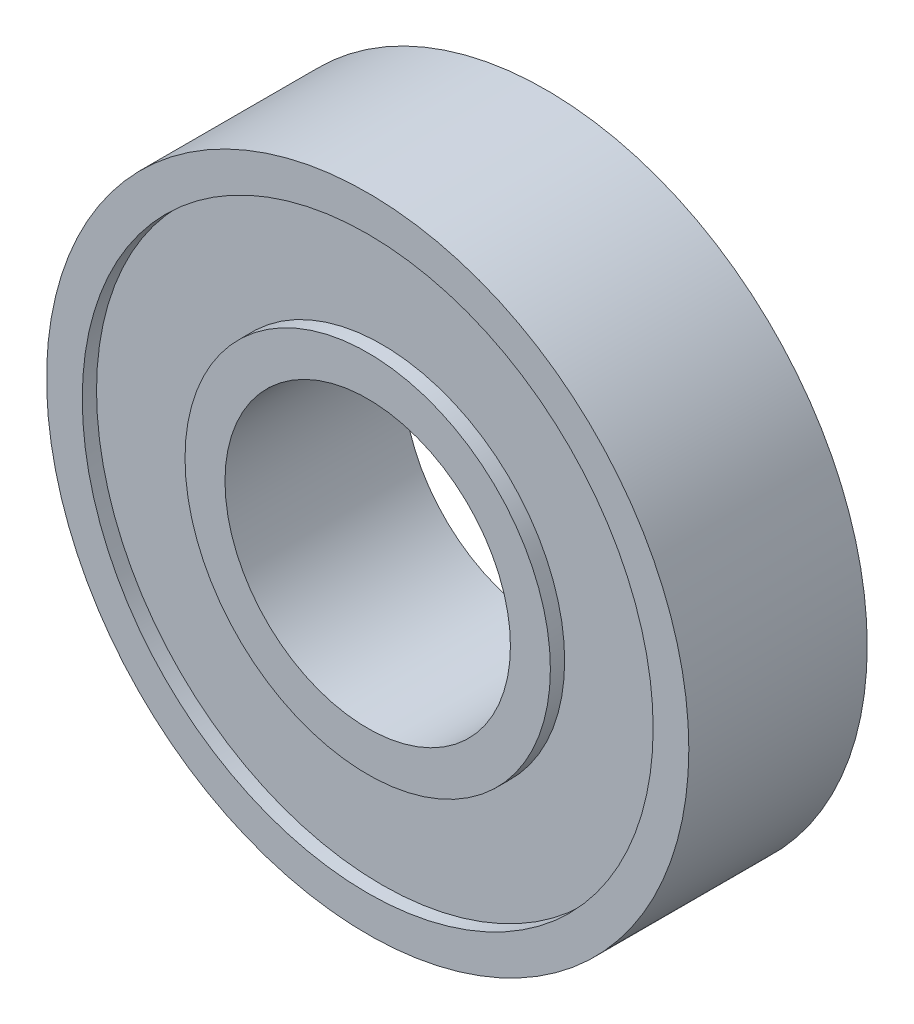
ISO-10303-21;
HEADER;
FILE_DESCRIPTION(('STEP AP214'),'2;1');
FILE_NAME('part.step','',(''),(''),'','','');
FILE_SCHEMA(('AUTOMOTIVE_DESIGN { 1 0 10303 214 1 1 1 1 }'));
ENDSEC;
DATA;
#1=APPLICATION_CONTEXT('core data for automotive mechanical design processes');
#2=APPLICATION_PROTOCOL_DEFINITION('international standard','automotive_design',2000,#1);
#3=PRODUCT_CONTEXT('',#1,'mechanical');
#4=PRODUCT('Part','Part','',(#3));
#5=PRODUCT_RELATED_PRODUCT_CATEGORY('part','',(#4));
#6=PRODUCT_DEFINITION_FORMATION('','',#4);
#7=PRODUCT_DEFINITION_CONTEXT('part definition',#1,'design');
#8=PRODUCT_DEFINITION('design','',#6,#7);
#9=PRODUCT_DEFINITION_SHAPE('','',#8);
#10=(LENGTH_UNIT() NAMED_UNIT(*) SI_UNIT(.MILLI.,.METRE.));
#11=(NAMED_UNIT(*) PLANE_ANGLE_UNIT() SI_UNIT($,.RADIAN.));
#12=(NAMED_UNIT(*) SI_UNIT($,.STERADIAN.) SOLID_ANGLE_UNIT());
#13=UNCERTAINTY_MEASURE_WITH_UNIT(LENGTH_MEASURE(1.E-05),#10,'distance_accuracy_value','');
#14=(GEOMETRIC_REPRESENTATION_CONTEXT(3) GLOBAL_UNCERTAINTY_ASSIGNED_CONTEXT((#13)) GLOBAL_UNIT_ASSIGNED_CONTEXT((#10,
#11,#12)) REPRESENTATION_CONTEXT('',''));
#15=CARTESIAN_POINT('',(0.,0.,0.));
#16=DIRECTION('',(0.,0.,1.));
#17=DIRECTION('',(1.,0.,0.));
#18=AXIS2_PLACEMENT_3D('',#15,#16,#17);
#19=CARTESIAN_POINT('',(0.,0.,-3.33375));
#20=DIRECTION('',(0.,0.,1.));
#21=DIRECTION('',(0.,-1.,0.));
#22=AXIS2_PLACEMENT_3D('',#19,#20,#21);
#23=CYLINDRICAL_SURFACE('',#22,8.128);
#24=CARTESIAN_POINT('',(0.,0.,-3.96875));
#25=DIRECTION('',(0.,0.,1.));
#26=DIRECTION('',(0.,-1.,0.));
#27=AXIS2_PLACEMENT_3D('',#24,#25,#26);
#28=CIRCLE('',#27,8.128);
#29=CARTESIAN_POINT('',(0.,-8.128,-3.96875));
#30=VERTEX_POINT('',#29);
#31=EDGE_CURVE('E53',#30,#30,#28,.F.);
#32=ORIENTED_EDGE('',*,*,#31,.F.);
#33=EDGE_LOOP('',(#32));
#34=FACE_BOUND('',#33,.T.);
#35=CARTESIAN_POINT('',(0.,0.,-3.33375));
#36=DIRECTION('',(0.,0.,1.));
#37=DIRECTION('',(0.,-1.,0.));
#38=AXIS2_PLACEMENT_3D('',#35,#36,#37);
#39=CIRCLE('',#38,8.128);
#40=CARTESIAN_POINT('',(0.,-8.128,-3.33375));
#41=VERTEX_POINT('',#40);
#42=EDGE_CURVE('E19',#41,#41,#39,.T.);
#43=ORIENTED_EDGE('',*,*,#42,.F.);
#44=EDGE_LOOP('',(#43));
#45=FACE_BOUND('',#44,.T.);
#46=ADVANCED_FACE('F15',(#34,#45),#23,.T.);
#47=CARTESIAN_POINT('',(13.97,-13.97,-3.33375));
#48=DIRECTION('',(0.,0.,-1.));
#49=DIRECTION('',(-1.,0.,0.));
#50=AXIS2_PLACEMENT_3D('',#47,#48,#49);
#51=PLANE('',#50);
#52=ORIENTED_EDGE('',*,*,#42,.T.);
#53=EDGE_LOOP('',(#52));
#54=FACE_BOUND('',#53,.T.);
#55=CARTESIAN_POINT('',(0.,0.,-3.33375));
#56=DIRECTION('',(0.,0.,1.));
#57=DIRECTION('',(1.,0.,0.));
#58=AXIS2_PLACEMENT_3D('',#55,#56,#57);
#59=CIRCLE('',#58,12.7);
#60=CARTESIAN_POINT('',(12.7,0.,-3.33375));
#61=VERTEX_POINT('',#60);
#62=EDGE_CURVE('E51',#61,#61,#59,.T.);
#63=ORIENTED_EDGE('',*,*,#62,.F.);
#64=EDGE_LOOP('',(#63));
#65=FACE_BOUND('',#64,.T.);
#66=ADVANCED_FACE('F60',(#54,#65),#51,.T.);
#67=CARTESIAN_POINT('',(8.9408,-8.9408,-3.96875));
#68=DIRECTION('',(0.,0.,-1.));
#69=DIRECTION('',(-1.,0.,0.));
#70=AXIS2_PLACEMENT_3D('',#67,#68,#69);
#71=PLANE('',#70);
#72=CARTESIAN_POINT('',(0.,0.,-3.96875));
#73=DIRECTION('',(0.,0.,1.));
#74=DIRECTION('',(1.,0.,0.));
#75=AXIS2_PLACEMENT_3D('',#72,#73,#74);
#76=CIRCLE('',#75,6.35);
#77=CARTESIAN_POINT('',(6.35,0.,-3.96875));
#78=VERTEX_POINT('',#77);
#79=EDGE_CURVE('E48',#78,#78,#76,.F.);
#80=ORIENTED_EDGE('',*,*,#79,.F.);
#81=EDGE_LOOP('',(#80));
#82=FACE_BOUND('',#81,.T.);
#83=ORIENTED_EDGE('',*,*,#31,.T.);
#84=EDGE_LOOP('',(#83));
#85=FACE_BOUND('',#84,.T.);
#86=ADVANCED_FACE('F70',(#82,#85),#71,.T.);
#87=CARTESIAN_POINT('',(0.,0.,-3.96875));
#88=DIRECTION('',(0.,0.,1.));
#89=DIRECTION('',(1.,0.,0.));
#90=AXIS2_PLACEMENT_3D('',#87,#88,#89);
#91=CYLINDRICAL_SURFACE('',#90,12.7);
#92=ORIENTED_EDGE('',*,*,#62,.T.);
#93=EDGE_LOOP('',(#92));
#94=FACE_BOUND('',#93,.T.);
#95=CARTESIAN_POINT('',(0.,0.,-3.96875));
#96=DIRECTION('',(0.,0.,1.));
#97=DIRECTION('',(1.,0.,0.));
#98=AXIS2_PLACEMENT_3D('',#95,#96,#97);
#99=CIRCLE('',#98,12.7);
#100=CARTESIAN_POINT('',(12.7,0.,-3.96875));
#101=VERTEX_POINT('',#100);
#102=EDGE_CURVE('E45',#101,#101,#99,.T.);
#103=ORIENTED_EDGE('',*,*,#102,.F.);
#104=EDGE_LOOP('',(#103));
#105=FACE_BOUND('',#104,.T.);
#106=ADVANCED_FACE('F106',(#94,#105),#91,.F.);
#107=CARTESIAN_POINT('',(0.,0.,-3.96875));
#108=DIRECTION('',(0.,0.,1.));
#109=DIRECTION('',(1.,0.,0.));
#110=AXIS2_PLACEMENT_3D('',#107,#108,#109);
#111=CYLINDRICAL_SURFACE('',#110,6.35);
#112=CARTESIAN_POINT('',(0.,0.,3.96875));
#113=DIRECTION('',(0.,0.,1.));
#114=DIRECTION('',(1.,0.,0.));
#115=AXIS2_PLACEMENT_3D('',#112,#113,#114);
#116=CIRCLE('',#115,6.35);
#117=CARTESIAN_POINT('',(6.35,0.,3.96875));
#118=VERTEX_POINT('',#117);
#119=EDGE_CURVE('E42',#118,#118,#116,.F.);
#120=ORIENTED_EDGE('',*,*,#119,.F.);
#121=EDGE_LOOP('',(#120));
#122=FACE_BOUND('',#121,.T.);
#123=ORIENTED_EDGE('',*,*,#79,.T.);
#124=EDGE_LOOP('',(#123));
#125=FACE_BOUND('',#124,.T.);
#126=ADVANCED_FACE('F97',(#122,#125),#111,.F.);
#127=CARTESIAN_POINT('',(15.71625,-15.71625,-3.96875));
#128=DIRECTION('',(0.,0.,-1.));
#129=DIRECTION('',(-1.,0.,0.));
#130=AXIS2_PLACEMENT_3D('',#127,#128,#129);
#131=PLANE('',#130);
#132=ORIENTED_EDGE('',*,*,#102,.T.);
#133=EDGE_LOOP('',(#132));
#134=FACE_BOUND('',#133,.T.);
#135=CARTESIAN_POINT('',(0.,0.,-3.96875));
#136=DIRECTION('',(0.,0.,1.));
#137=DIRECTION('',(1.,0.,0.));
#138=AXIS2_PLACEMENT_3D('',#135,#136,#137);
#139=CIRCLE('',#138,14.2875);
#140=CARTESIAN_POINT('',(14.2875,0.,-3.96875));
#141=VERTEX_POINT('',#140);
#142=EDGE_CURVE('E39',#141,#141,#139,.T.);
#143=ORIENTED_EDGE('',*,*,#142,.F.);
#144=EDGE_LOOP('',(#143));
#145=FACE_BOUND('',#144,.T.);
#146=ADVANCED_FACE('F95',(#134,#145),#131,.T.);
#147=CARTESIAN_POINT('',(-8.9408,-8.9408,3.96875));
#148=DIRECTION('',(0.,0.,1.));
#149=DIRECTION('',(1.,0.,0.));
#150=AXIS2_PLACEMENT_3D('',#147,#148,#149);
#151=PLANE('',#150);
#152=ORIENTED_EDGE('',*,*,#119,.T.);
#153=EDGE_LOOP('',(#152));
#154=FACE_BOUND('',#153,.T.);
#155=CARTESIAN_POINT('',(0.,0.,3.96875));
#156=DIRECTION('',(0.,0.,1.));
#157=DIRECTION('',(1.,0.,0.));
#158=AXIS2_PLACEMENT_3D('',#155,#156,#157);
#159=CIRCLE('',#158,8.128);
#160=CARTESIAN_POINT('',(8.128,0.,3.96875));
#161=VERTEX_POINT('',#160);
#162=EDGE_CURVE('E36',#161,#161,#159,.F.);
#163=ORIENTED_EDGE('',*,*,#162,.F.);
#164=EDGE_LOOP('',(#163));
#165=FACE_BOUND('',#164,.T.);
#166=ADVANCED_FACE('F91',(#154,#165),#151,.T.);
#167=CARTESIAN_POINT('',(0.,0.,3.96875));
#168=DIRECTION('',(0.,0.,1.));
#169=DIRECTION('',(1.,0.,0.));
#170=AXIS2_PLACEMENT_3D('',#167,#168,#169);
#171=CYLINDRICAL_SURFACE('',#170,14.2875);
#172=CARTESIAN_POINT('',(0.,0.,3.96875));
#173=DIRECTION('',(0.,0.,1.));
#174=DIRECTION('',(1.,0.,0.));
#175=AXIS2_PLACEMENT_3D('',#172,#173,#174);
#176=CIRCLE('',#175,14.2875);
#177=CARTESIAN_POINT('',(14.2875,0.,3.96875));
#178=VERTEX_POINT('',#177);
#179=EDGE_CURVE('E33',#178,#178,#176,.T.);
#180=ORIENTED_EDGE('',*,*,#179,.F.);
#181=EDGE_LOOP('',(#180));
#182=FACE_BOUND('',#181,.T.);
#183=ORIENTED_EDGE('',*,*,#142,.T.);
#184=EDGE_LOOP('',(#183));
#185=FACE_BOUND('',#184,.T.);
#186=ADVANCED_FACE('F88',(#182,#185),#171,.T.);
#187=CARTESIAN_POINT('',(0.,0.,3.96875));
#188=DIRECTION('',(0.,0.,1.));
#189=DIRECTION('',(1.,0.,0.));
#190=AXIS2_PLACEMENT_3D('',#187,#188,#189);
#191=CYLINDRICAL_SURFACE('',#190,8.128);
#192=CARTESIAN_POINT('',(0.,0.,3.33375));
#193=DIRECTION('',(0.,0.,1.));
#194=DIRECTION('',(1.,0.,0.));
#195=AXIS2_PLACEMENT_3D('',#192,#193,#194);
#196=CIRCLE('',#195,8.128);
#197=CARTESIAN_POINT('',(8.128,0.,3.33375));
#198=VERTEX_POINT('',#197);
#199=EDGE_CURVE('E28',#198,#198,#196,.F.);
#200=ORIENTED_EDGE('',*,*,#199,.F.);
#201=EDGE_LOOP('',(#200));
#202=FACE_BOUND('',#201,.T.);
#203=ORIENTED_EDGE('',*,*,#162,.T.);
#204=EDGE_LOOP('',(#203));
#205=FACE_BOUND('',#204,.T.);
#206=ADVANCED_FACE('F84',(#202,#205),#191,.T.);
#207=CARTESIAN_POINT('',(-15.71625,-15.71625,3.96875));
#208=DIRECTION('',(0.,0.,1.));
#209=DIRECTION('',(1.,0.,0.));
#210=AXIS2_PLACEMENT_3D('',#207,#208,#209);
#211=PLANE('',#210);
#212=CARTESIAN_POINT('',(0.,0.,3.96875));
#213=DIRECTION('',(0.,0.,1.));
#214=DIRECTION('',(0.,-1.,0.));
#215=AXIS2_PLACEMENT_3D('',#212,#213,#214);
#216=CIRCLE('',#215,12.7);
#217=CARTESIAN_POINT('',(0.,-12.7,3.96875));
#218=VERTEX_POINT('',#217);
#219=EDGE_CURVE('E23',#218,#218,#216,.T.);
#220=ORIENTED_EDGE('',*,*,#219,.F.);
#221=EDGE_LOOP('',(#220));
#222=FACE_BOUND('',#221,.T.);
#223=ORIENTED_EDGE('',*,*,#179,.T.);
#224=EDGE_LOOP('',(#223));
#225=FACE_BOUND('',#224,.T.);
#226=ADVANCED_FACE('F77',(#222,#225),#211,.T.);
#227=CARTESIAN_POINT('',(-13.97,-13.97,3.33375));
#228=DIRECTION('',(0.,0.,1.));
#229=DIRECTION('',(1.,0.,0.));
#230=AXIS2_PLACEMENT_3D('',#227,#228,#229);
#231=PLANE('',#230);
#232=ORIENTED_EDGE('',*,*,#199,.T.);
#233=EDGE_LOOP('',(#232));
#234=FACE_BOUND('',#233,.T.);
#235=CARTESIAN_POINT('',(0.,0.,3.33375));
#236=DIRECTION('',(0.,0.,1.));
#237=DIRECTION('',(0.,-1.,0.));
#238=AXIS2_PLACEMENT_3D('',#235,#236,#237);
#239=CIRCLE('',#238,12.7);
#240=CARTESIAN_POINT('',(0.,-12.7,3.33375));
#241=VERTEX_POINT('',#240);
#242=EDGE_CURVE('E10',#241,#241,#239,.F.);
#243=ORIENTED_EDGE('',*,*,#242,.F.);
#244=EDGE_LOOP('',(#243));
#245=FACE_BOUND('',#244,.T.);
#246=ADVANCED_FACE('F73',(#234,#245),#231,.T.);
#247=CARTESIAN_POINT('',(0.,0.,3.33375));
#248=DIRECTION('',(0.,0.,1.));
#249=DIRECTION('',(0.,-1.,0.));
#250=AXIS2_PLACEMENT_3D('',#247,#248,#249);
#251=CYLINDRICAL_SURFACE('',#250,12.7);
#252=ORIENTED_EDGE('',*,*,#242,.T.);
#253=EDGE_LOOP('',(#252));
#254=FACE_BOUND('',#253,.T.);
#255=ORIENTED_EDGE('',*,*,#219,.T.);
#256=EDGE_LOOP('',(#255));
#257=FACE_BOUND('',#256,.T.);
#258=ADVANCED_FACE('F17',(#254,#257),#251,.F.);
#259=CLOSED_SHELL('',(#46,#66,#86,#106,#126,#146,#166,#186,#206,#226,#246,#258));
#260=MANIFOLD_SOLID_BREP('B1',#259);
#261=ADVANCED_BREP_SHAPE_REPRESENTATION('',(#18,#260),#14);
#262=SHAPE_DEFINITION_REPRESENTATION(#9,#261);
ENDSEC;
END-ISO-10303-21;
